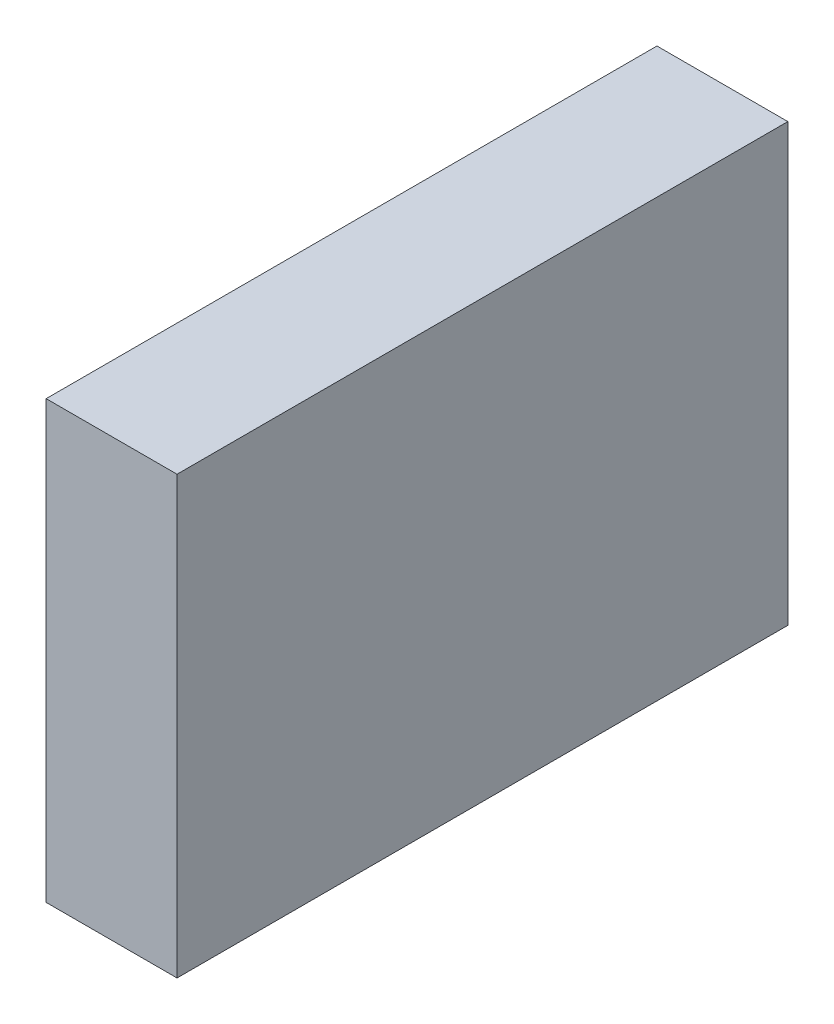
ISO-10303-21;
HEADER;
FILE_DESCRIPTION(('STEP AP214'),'2;1');
FILE_NAME('part.step','',(''),(''),'','','');
FILE_SCHEMA(('AUTOMOTIVE_DESIGN { 1 0 10303 214 1 1 1 1 }'));
ENDSEC;
DATA;
#1=APPLICATION_CONTEXT('core data for automotive mechanical design processes');
#2=APPLICATION_PROTOCOL_DEFINITION('international standard','automotive_design',2000,#1);
#3=PRODUCT_CONTEXT('',#1,'mechanical');
#4=PRODUCT('Part','Part','',(#3));
#5=PRODUCT_RELATED_PRODUCT_CATEGORY('part','',(#4));
#6=PRODUCT_DEFINITION_FORMATION('','',#4);
#7=PRODUCT_DEFINITION_CONTEXT('part definition',#1,'design');
#8=PRODUCT_DEFINITION('design','',#6,#7);
#9=PRODUCT_DEFINITION_SHAPE('','',#8);
#10=(LENGTH_UNIT() NAMED_UNIT(*) SI_UNIT(.MILLI.,.METRE.));
#11=(NAMED_UNIT(*) PLANE_ANGLE_UNIT() SI_UNIT($,.RADIAN.));
#12=(NAMED_UNIT(*) SI_UNIT($,.STERADIAN.) SOLID_ANGLE_UNIT());
#13=UNCERTAINTY_MEASURE_WITH_UNIT(LENGTH_MEASURE(1.E-05),#10,'distance_accuracy_value','');
#14=(GEOMETRIC_REPRESENTATION_CONTEXT(3) GLOBAL_UNCERTAINTY_ASSIGNED_CONTEXT((#13)) GLOBAL_UNIT_ASSIGNED_CONTEXT((#10,
#11,#12)) REPRESENTATION_CONTEXT('',''));
#15=CARTESIAN_POINT('',(0.,0.,0.));
#16=DIRECTION('',(0.,0.,1.));
#17=DIRECTION('',(1.,0.,0.));
#18=AXIS2_PLACEMENT_3D('',#15,#16,#17);
#19=CARTESIAN_POINT('',(2.99999968178106,-1.8200007020049,-3.72112168010555));
#20=DIRECTION('',(1.,-1.74845553146952E-07,0.));
#21=DIRECTION('',(1.74845553146952E-07,1.,8.74227765734759E-08));
#22=AXIS2_PLACEMENT_3D('',#19,#20,#21);
#23=PLANE('',#22);
#24=DIRECTION('',(1.74845553146599E-07,0.999999999999981,8.74227765732993E-08));
#25=VECTOR('',#24,1.);
#26=CARTESIAN_POINT('',(2.99999969402025,-1.75000070812449,-3.65112167398595));
#27=LINE('',#26,#25);
#28=CARTESIAN_POINT('',(2.99999969402025,-1.75000070812349,-3.65112167398595));
#29=VERTEX_POINT('',#28);
#30=CARTESIAN_POINT('',(2.9999998688658,-0.75000070812249,-3.65112158656218));
#31=VERTEX_POINT('',#30);
#32=EDGE_CURVE('E11',#29,#31,#27,.T.);
#33=ORIENTED_EDGE('',*,*,#32,.F.);
#34=DIRECTION('',(0.,8.74227766369168E-08,-0.999999999999996));
#35=VECTOR('',#34,1.);
#36=CARTESIAN_POINT('',(2.99999969402023,-1.75000083051638,-2.25112167398595));
#37=LINE('',#36,#35);
#38=CARTESIAN_POINT('',(2.99999969402023,-1.75000083051638,-2.25112167398695));
#39=VERTEX_POINT('',#38);
#40=EDGE_CURVE('E59',#39,#29,#37,.T.);
#41=ORIENTED_EDGE('',*,*,#40,.F.);
#42=DIRECTION('',(-1.74845553146599E-07,-0.999999999999981,-8.74227765732994E-08));
#43=VECTOR('',#42,1.);
#44=CARTESIAN_POINT('',(2.99999986886578,-0.750000830514377,-2.25112158656318));
#45=LINE('',#44,#43);
#46=CARTESIAN_POINT('',(2.99999986886578,-0.750000830515378,-2.25112158656318));
#47=VERTEX_POINT('',#46);
#48=EDGE_CURVE('E79',#47,#39,#45,.T.);
#49=ORIENTED_EDGE('',*,*,#48,.F.);
#50=DIRECTION('',(0.,-8.74227765576152E-08,0.999999999999996));
#51=VECTOR('',#50,1.);
#52=CARTESIAN_POINT('',(2.9999998688658,-0.75000070812249,-3.65112158656318));
#53=LINE('',#52,#51);
#54=EDGE_CURVE('E84',#31,#47,#53,.T.);
#55=ORIENTED_EDGE('',*,*,#54,.F.);
#56=EDGE_LOOP('',(#33,#41,#49,#55));
#57=FACE_BOUND('',#56,.T.);
#58=ADVANCED_FACE('F17',(#57),#23,.F.);
#59=CARTESIAN_POINT('',(3.29999968178106,-1.82000075445856,-3.72112168010555));
#60=DIRECTION('',(1.,-1.74845553146952E-07,0.));
#61=DIRECTION('',(1.74845553146952E-07,1.,8.74227765734759E-08));
#62=AXIS2_PLACEMENT_3D('',#59,#60,#61);
#63=PLANE('',#62);
#64=DIRECTION('',(0.,-8.74227765576152E-08,0.999999999999996));
#65=VECTOR('',#64,1.);
#66=CARTESIAN_POINT('',(3.2999998688658,-0.750000760576156,-3.65112158656318));
#67=LINE('',#66,#65);
#68=CARTESIAN_POINT('',(3.2999998688658,-0.750000760576156,-3.65112158656218));
#69=VERTEX_POINT('',#68);
#70=CARTESIAN_POINT('',(3.29999986886578,-0.750000882969043,-2.25112158656318));
#71=VERTEX_POINT('',#70);
#72=EDGE_CURVE('E24',#69,#71,#67,.T.);
#73=ORIENTED_EDGE('',*,*,#72,.T.);
#74=DIRECTION('',(-1.74845553146599E-07,-0.999999999999981,-8.74227765732994E-08));
#75=VECTOR('',#74,1.);
#76=CARTESIAN_POINT('',(3.29999986886578,-0.750000882968044,-2.25112158656318));
#77=LINE('',#76,#75);
#78=CARTESIAN_POINT('',(3.29999969402023,-1.75000088297004,-2.25112167398695));
#79=VERTEX_POINT('',#78);
#80=EDGE_CURVE('E82',#71,#79,#77,.T.);
#81=ORIENTED_EDGE('',*,*,#80,.T.);
#82=DIRECTION('',(0.,8.74227764783136E-08,-0.999999999999996));
#83=VECTOR('',#82,1.);
#84=CARTESIAN_POINT('',(3.29999969402023,-1.75000088297004,-2.25112167398595));
#85=LINE('',#84,#83);
#86=CARTESIAN_POINT('',(3.29999969402025,-1.75000076057716,-3.65112167398595));
#87=VERTEX_POINT('',#86);
#88=EDGE_CURVE('E64',#79,#87,#85,.T.);
#89=ORIENTED_EDGE('',*,*,#88,.T.);
#90=DIRECTION('',(1.74845553146599E-07,0.999999999999981,8.74227765732993E-08));
#91=VECTOR('',#90,1.);
#92=CARTESIAN_POINT('',(3.29999969402025,-1.75000076057816,-3.65112167398595));
#93=LINE('',#92,#91);
#94=EDGE_CURVE('E61',#87,#69,#93,.T.);
#95=ORIENTED_EDGE('',*,*,#94,.T.);
#96=EDGE_LOOP('',(#73,#81,#89,#95));
#97=FACE_BOUND('',#96,.T.);
#98=ADVANCED_FACE('F62',(#97),#63,.T.);
#99=CARTESIAN_POINT('',(2.9999998688658,-0.75000070812249,-3.65112158656318));
#100=DIRECTION('',(1.74845553146952E-07,1.,8.74227765734759E-08));
#101=DIRECTION('',(0.,-8.74227765734759E-08,1.));
#102=AXIS2_PLACEMENT_3D('',#99,#100,#101);
#103=PLANE('',#102);
#104=ORIENTED_EDGE('',*,*,#54,.T.);
#105=DIRECTION('',(0.999999999999985,-1.74845553220964E-07,0.));
#106=VECTOR('',#105,1.);
#107=CARTESIAN_POINT('',(2.99999986886578,-0.750000830514378,-2.25112158656318));
#108=LINE('',#107,#106);
#109=EDGE_CURVE('E57',#47,#71,#108,.T.);
#110=ORIENTED_EDGE('',*,*,#109,.T.);
#111=ORIENTED_EDGE('',*,*,#72,.F.);
#112=DIRECTION('',(0.999999999999985,-1.74845553220964E-07,0.));
#113=VECTOR('',#112,1.);
#114=CARTESIAN_POINT('',(2.9999998688658,-0.75000070812249,-3.65112158656318));
#115=LINE('',#114,#113);
#116=EDGE_CURVE('E55',#31,#69,#115,.T.);
#117=ORIENTED_EDGE('',*,*,#116,.F.);
#118=EDGE_LOOP('',(#104,#110,#111,#117));
#119=FACE_BOUND('',#118,.T.);
#120=ADVANCED_FACE('F53',(#119),#103,.T.);
#121=CARTESIAN_POINT('',(2.99999986886578,-0.750000830514378,-2.25112158656318));
#122=DIRECTION('',(0.,-8.74227765734759E-08,1.));
#123=DIRECTION('',(-1.74845553146952E-07,-1.,-8.74227765734759E-08));
#124=AXIS2_PLACEMENT_3D('',#121,#122,#123);
#125=PLANE('',#124);
#126=ORIENTED_EDGE('',*,*,#48,.T.);
#127=DIRECTION('',(0.999999999999985,-1.7484555285089E-07,0.));
#128=VECTOR('',#127,1.);
#129=CARTESIAN_POINT('',(2.99999969402023,-1.75000083051638,-2.25112167398595));
#130=LINE('',#129,#128);
#131=EDGE_CURVE('E68',#39,#79,#130,.T.);
#132=ORIENTED_EDGE('',*,*,#131,.T.);
#133=ORIENTED_EDGE('',*,*,#80,.F.);
#134=ORIENTED_EDGE('',*,*,#109,.F.);
#135=EDGE_LOOP('',(#126,#132,#133,#134));
#136=FACE_BOUND('',#135,.T.);
#137=ADVANCED_FACE('F91',(#136),#125,.T.);
#138=CARTESIAN_POINT('',(2.99999969402023,-1.75000083051638,-2.25112167398595));
#139=DIRECTION('',(-1.74845553146952E-07,-1.,-8.74227765734759E-08));
#140=DIRECTION('',(0.,8.74227765734759E-08,-1.));
#141=AXIS2_PLACEMENT_3D('',#138,#139,#140);
#142=PLANE('',#141);
#143=ORIENTED_EDGE('',*,*,#40,.T.);
#144=DIRECTION('',(0.999999999999985,-1.7484555285089E-07,0.));
#145=VECTOR('',#144,1.);
#146=CARTESIAN_POINT('',(2.99999969402025,-1.75000070812449,-3.65112167398595));
#147=LINE('',#146,#145);
#148=EDGE_CURVE('E69',#29,#87,#147,.T.);
#149=ORIENTED_EDGE('',*,*,#148,.T.);
#150=ORIENTED_EDGE('',*,*,#88,.F.);
#151=ORIENTED_EDGE('',*,*,#131,.F.);
#152=EDGE_LOOP('',(#143,#149,#150,#151));
#153=FACE_BOUND('',#152,.T.);
#154=ADVANCED_FACE('F88',(#153),#142,.T.);
#155=CARTESIAN_POINT('',(2.99999969402025,-1.75000070812449,-3.65112167398595));
#156=DIRECTION('',(0.,8.74227765734759E-08,-1.));
#157=DIRECTION('',(1.74845553146952E-07,1.,8.74227765734759E-08));
#158=AXIS2_PLACEMENT_3D('',#155,#156,#157);
#159=PLANE('',#158);
#160=ORIENTED_EDGE('',*,*,#32,.T.);
#161=ORIENTED_EDGE('',*,*,#116,.T.);
#162=ORIENTED_EDGE('',*,*,#94,.F.);
#163=ORIENTED_EDGE('',*,*,#148,.F.);
#164=EDGE_LOOP('',(#160,#161,#162,#163));
#165=FACE_BOUND('',#164,.T.);
#166=ADVANCED_FACE('F71',(#165),#159,.T.);
#167=CLOSED_SHELL('',(#58,#98,#120,#137,#154,#166));
#168=MANIFOLD_SOLID_BREP('B1',#167);
#169=ADVANCED_BREP_SHAPE_REPRESENTATION('',(#18,#168),#14);
#170=SHAPE_DEFINITION_REPRESENTATION(#9,#169);
ENDSEC;
END-ISO-10303-21;
